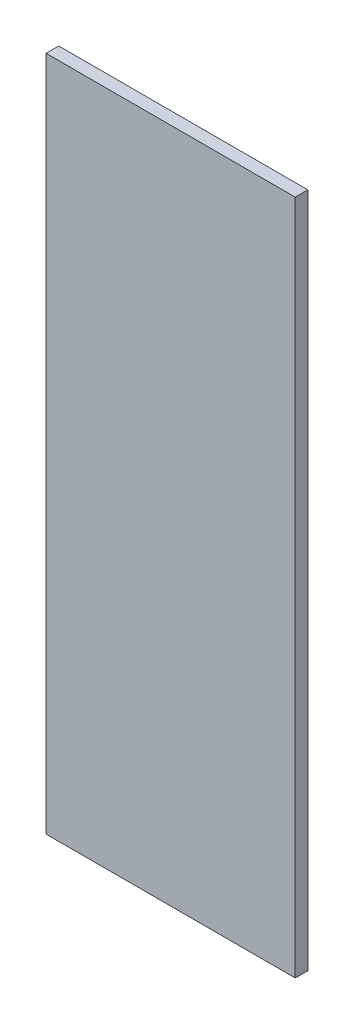
ISO-10303-21;
HEADER;
FILE_DESCRIPTION(('STEP AP214'),'2;1');
FILE_NAME('part.step','',(''),(''),'','','');
FILE_SCHEMA(('AUTOMOTIVE_DESIGN { 1 0 10303 214 1 1 1 1 }'));
ENDSEC;
DATA;
#1=APPLICATION_CONTEXT('core data for automotive mechanical design processes');
#2=APPLICATION_PROTOCOL_DEFINITION('international standard','automotive_design',2000,#1);
#3=PRODUCT_CONTEXT('',#1,'mechanical');
#4=PRODUCT('Part','Part','',(#3));
#5=PRODUCT_RELATED_PRODUCT_CATEGORY('part','',(#4));
#6=PRODUCT_DEFINITION_FORMATION('','',#4);
#7=PRODUCT_DEFINITION_CONTEXT('part definition',#1,'design');
#8=PRODUCT_DEFINITION('design','',#6,#7);
#9=PRODUCT_DEFINITION_SHAPE('','',#8);
#10=(LENGTH_UNIT() NAMED_UNIT(*) SI_UNIT(.MILLI.,.METRE.));
#11=(NAMED_UNIT(*) PLANE_ANGLE_UNIT() SI_UNIT($,.RADIAN.));
#12=(NAMED_UNIT(*) SI_UNIT($,.STERADIAN.) SOLID_ANGLE_UNIT());
#13=UNCERTAINTY_MEASURE_WITH_UNIT(LENGTH_MEASURE(1.E-05),#10,'distance_accuracy_value','');
#14=(GEOMETRIC_REPRESENTATION_CONTEXT(3) GLOBAL_UNCERTAINTY_ASSIGNED_CONTEXT((#13)) GLOBAL_UNIT_ASSIGNED_CONTEXT((#10,
#11,#12)) REPRESENTATION_CONTEXT('',''));
#15=CARTESIAN_POINT('',(0.,0.,0.));
#16=DIRECTION('',(0.,0.,1.));
#17=DIRECTION('',(1.,0.,0.));
#18=AXIS2_PLACEMENT_3D('',#15,#16,#17);
#19=CARTESIAN_POINT('',(89.1920013427734,53.8279991149902,0.));
#20=DIRECTION('',(1.,0.,0.));
#21=DIRECTION('',(0.,-1.,0.));
#22=AXIS2_PLACEMENT_3D('',#19,#20,#21);
#23=PLANE('',#22);
#24=DIRECTION('',(0.,-1.,0.));
#25=VECTOR('',#24,1.);
#26=CARTESIAN_POINT('',(89.1920013427734,53.8279991149902,0.03556));
#27=LINE('',#26,#25);
#28=CARTESIAN_POINT('',(89.1920013427734,53.8279991149902,0.03556));
#29=VERTEX_POINT('',#28);
#30=CARTESIAN_POINT('',(89.1920013427734,51.9280014038086,0.03556));
#31=VERTEX_POINT('',#30);
#32=EDGE_CURVE('E11',#29,#31,#27,.T.);
#33=ORIENTED_EDGE('',*,*,#32,.F.);
#34=DIRECTION('',(0.,0.,1.));
#35=VECTOR('',#34,1.);
#36=CARTESIAN_POINT('',(89.1920013427734,53.8279991149902,0.));
#37=LINE('',#36,#35);
#38=CARTESIAN_POINT('',(89.1920013427734,53.8279991149902,0.));
#39=VERTEX_POINT('',#38);
#40=EDGE_CURVE('E24',#39,#29,#37,.T.);
#41=ORIENTED_EDGE('',*,*,#40,.F.);
#42=DIRECTION('',(0.,-1.,0.));
#43=VECTOR('',#42,1.);
#44=CARTESIAN_POINT('',(89.1920013427734,53.8279991149902,0.));
#45=LINE('',#44,#43);
#46=CARTESIAN_POINT('',(89.1920013427734,51.9280014038086,0.));
#47=VERTEX_POINT('',#46);
#48=EDGE_CURVE('E75',#39,#47,#45,.T.);
#49=ORIENTED_EDGE('',*,*,#48,.T.);
#50=DIRECTION('',(0.,0.,1.));
#51=VECTOR('',#50,1.);
#52=CARTESIAN_POINT('',(89.1920013427734,51.9280014038086,0.));
#53=LINE('',#52,#51);
#54=EDGE_CURVE('E37',#47,#31,#53,.T.);
#55=ORIENTED_EDGE('',*,*,#54,.T.);
#56=EDGE_LOOP('',(#33,#41,#49,#55));
#57=FACE_BOUND('',#56,.T.);
#58=ADVANCED_FACE('F17',(#57),#23,.F.);
#59=CARTESIAN_POINT('',(89.1920013427734,51.9280014038086,0.));
#60=DIRECTION('',(0.,1.,0.));
#61=DIRECTION('',(1.,0.,0.));
#62=AXIS2_PLACEMENT_3D('',#59,#60,#61);
#63=PLANE('',#62);
#64=DIRECTION('',(1.,0.,0.));
#65=VECTOR('',#64,1.);
#66=CARTESIAN_POINT('',(89.1920013427734,51.9280014038086,0.03556));
#67=LINE('',#66,#65);
#68=CARTESIAN_POINT('',(89.8919982910156,51.9280014038086,0.03556));
#69=VERTEX_POINT('',#68);
#70=EDGE_CURVE('E83',#31,#69,#67,.T.);
#71=ORIENTED_EDGE('',*,*,#70,.F.);
#72=ORIENTED_EDGE('',*,*,#54,.F.);
#73=DIRECTION('',(1.,0.,0.));
#74=VECTOR('',#73,1.);
#75=CARTESIAN_POINT('',(89.1920013427734,51.9280014038086,0.));
#76=LINE('',#75,#74);
#77=CARTESIAN_POINT('',(89.8919982910156,51.9280014038086,0.));
#78=VERTEX_POINT('',#77);
#79=EDGE_CURVE('E81',#47,#78,#76,.T.);
#80=ORIENTED_EDGE('',*,*,#79,.T.);
#81=DIRECTION('',(0.,0.,1.));
#82=VECTOR('',#81,1.);
#83=CARTESIAN_POINT('',(89.8919982910156,51.9280014038086,0.));
#84=LINE('',#83,#82);
#85=EDGE_CURVE('E67',#78,#69,#84,.T.);
#86=ORIENTED_EDGE('',*,*,#85,.T.);
#87=EDGE_LOOP('',(#71,#72,#80,#86));
#88=FACE_BOUND('',#87,.T.);
#89=ADVANCED_FACE('F89',(#88),#63,.F.);
#90=CARTESIAN_POINT('',(89.8919982910156,51.9280014038086,0.));
#91=DIRECTION('',(-1.,0.,0.));
#92=DIRECTION('',(0.,1.,0.));
#93=AXIS2_PLACEMENT_3D('',#90,#91,#92);
#94=PLANE('',#93);
#95=DIRECTION('',(0.,1.,0.));
#96=VECTOR('',#95,1.);
#97=CARTESIAN_POINT('',(89.8919982910156,51.9280014038086,0.03556));
#98=LINE('',#97,#96);
#99=CARTESIAN_POINT('',(89.8919982910156,53.8279991149902,0.03556));
#100=VERTEX_POINT('',#99);
#101=EDGE_CURVE('E71',#69,#100,#98,.T.);
#102=ORIENTED_EDGE('',*,*,#101,.F.);
#103=ORIENTED_EDGE('',*,*,#85,.F.);
#104=DIRECTION('',(0.,1.,0.));
#105=VECTOR('',#104,1.);
#106=CARTESIAN_POINT('',(89.8919982910156,51.9280014038086,0.));
#107=LINE('',#106,#105);
#108=CARTESIAN_POINT('',(89.8919982910156,53.8279991149902,0.));
#109=VERTEX_POINT('',#108);
#110=EDGE_CURVE('E63',#78,#109,#107,.T.);
#111=ORIENTED_EDGE('',*,*,#110,.T.);
#112=DIRECTION('',(0.,0.,1.));
#113=VECTOR('',#112,1.);
#114=CARTESIAN_POINT('',(89.8919982910156,53.8279991149902,0.));
#115=LINE('',#114,#113);
#116=EDGE_CURVE('E53',#109,#100,#115,.T.);
#117=ORIENTED_EDGE('',*,*,#116,.T.);
#118=EDGE_LOOP('',(#102,#103,#111,#117));
#119=FACE_BOUND('',#118,.T.);
#120=ADVANCED_FACE('F66',(#119),#94,.F.);
#121=CARTESIAN_POINT('',(89.8919982910156,53.8279991149902,0.));
#122=DIRECTION('',(0.,-1.,0.));
#123=DIRECTION('',(-1.,0.,0.));
#124=AXIS2_PLACEMENT_3D('',#121,#122,#123);
#125=PLANE('',#124);
#126=DIRECTION('',(-1.,0.,0.));
#127=VECTOR('',#126,1.);
#128=CARTESIAN_POINT('',(89.8919982910156,53.8279991149902,0.03556));
#129=LINE('',#128,#127);
#130=EDGE_CURVE('E59',#100,#29,#129,.T.);
#131=ORIENTED_EDGE('',*,*,#130,.F.);
#132=ORIENTED_EDGE('',*,*,#116,.F.);
#133=DIRECTION('',(-1.,0.,0.));
#134=VECTOR('',#133,1.);
#135=CARTESIAN_POINT('',(89.8919982910156,53.8279991149902,0.));
#136=LINE('',#135,#134);
#137=EDGE_CURVE('E57',#109,#39,#136,.T.);
#138=ORIENTED_EDGE('',*,*,#137,.T.);
#139=ORIENTED_EDGE('',*,*,#40,.T.);
#140=EDGE_LOOP('',(#131,#132,#138,#139));
#141=FACE_BOUND('',#140,.T.);
#142=ADVANCED_FACE('F55',(#141),#125,.F.);
#143=CARTESIAN_POINT('',(89.1920013427734,53.8279991149902,0.));
#144=DIRECTION('',(0.,0.,-1.));
#145=DIRECTION('',(-1.,0.,0.));
#146=AXIS2_PLACEMENT_3D('',#143,#144,#145);
#147=PLANE('',#146);
#148=ORIENTED_EDGE('',*,*,#137,.F.);
#149=ORIENTED_EDGE('',*,*,#110,.F.);
#150=ORIENTED_EDGE('',*,*,#79,.F.);
#151=ORIENTED_EDGE('',*,*,#48,.F.);
#152=EDGE_LOOP('',(#148,#149,#150,#151));
#153=FACE_BOUND('',#152,.T.);
#154=ADVANCED_FACE('F74',(#153),#147,.T.);
#155=CARTESIAN_POINT('',(89.1920013427734,53.8279991149902,0.03556));
#156=DIRECTION('',(0.,0.,-1.));
#157=DIRECTION('',(-1.,0.,0.));
#158=AXIS2_PLACEMENT_3D('',#155,#156,#157);
#159=PLANE('',#158);
#160=ORIENTED_EDGE('',*,*,#32,.T.);
#161=ORIENTED_EDGE('',*,*,#70,.T.);
#162=ORIENTED_EDGE('',*,*,#101,.T.);
#163=ORIENTED_EDGE('',*,*,#130,.T.);
#164=EDGE_LOOP('',(#160,#161,#162,#163));
#165=FACE_BOUND('',#164,.T.);
#166=ADVANCED_FACE('F91',(#165),#159,.F.);
#167=CLOSED_SHELL('',(#58,#89,#120,#142,#154,#166));
#168=MANIFOLD_SOLID_BREP('B1',#167);
#169=ADVANCED_BREP_SHAPE_REPRESENTATION('',(#18,#168),#14);
#170=SHAPE_DEFINITION_REPRESENTATION(#9,#169);
ENDSEC;
END-ISO-10303-21;
